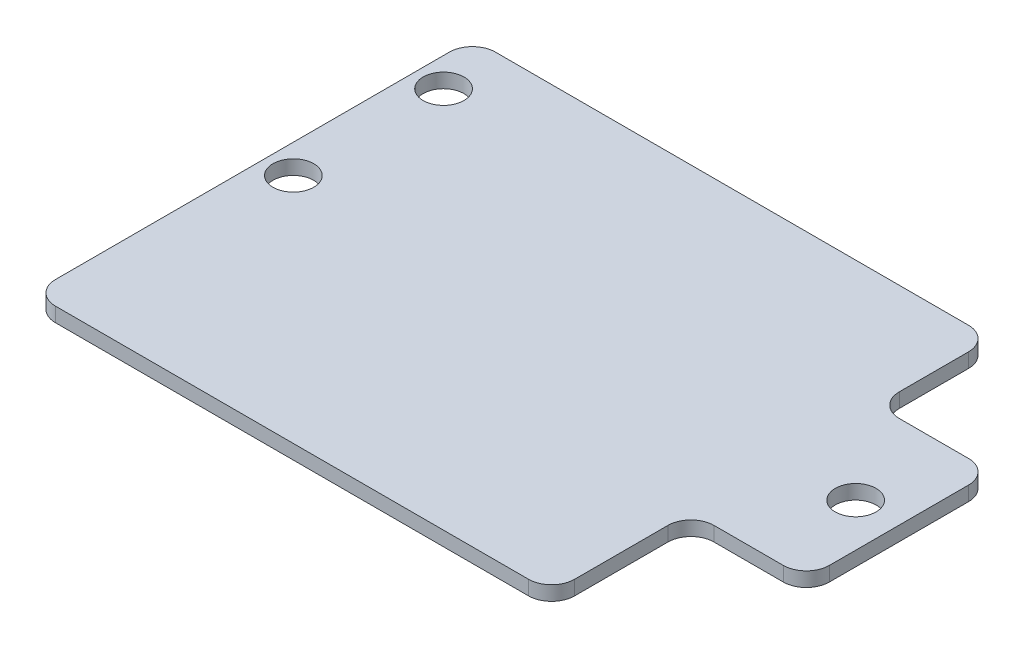
ISO-10303-21;
HEADER;
FILE_DESCRIPTION(('STEP AP214'),'2;1');
FILE_NAME('part.step','',(''),(''),'','','');
FILE_SCHEMA(('AUTOMOTIVE_DESIGN { 1 0 10303 214 1 1 1 1 }'));
ENDSEC;
DATA;
#1=APPLICATION_CONTEXT('core data for automotive mechanical design processes');
#2=APPLICATION_PROTOCOL_DEFINITION('international standard','automotive_design',2000,#1);
#3=PRODUCT_CONTEXT('',#1,'mechanical');
#4=PRODUCT('Part','Part','',(#3));
#5=PRODUCT_RELATED_PRODUCT_CATEGORY('part','',(#4));
#6=PRODUCT_DEFINITION_FORMATION('','',#4);
#7=PRODUCT_DEFINITION_CONTEXT('part definition',#1,'design');
#8=PRODUCT_DEFINITION('design','',#6,#7);
#9=PRODUCT_DEFINITION_SHAPE('','',#8);
#10=(LENGTH_UNIT() NAMED_UNIT(*) SI_UNIT(.MILLI.,.METRE.));
#11=(NAMED_UNIT(*) PLANE_ANGLE_UNIT() SI_UNIT($,.RADIAN.));
#12=(NAMED_UNIT(*) SI_UNIT($,.STERADIAN.) SOLID_ANGLE_UNIT());
#13=UNCERTAINTY_MEASURE_WITH_UNIT(LENGTH_MEASURE(1.E-05),#10,'distance_accuracy_value','');
#14=(GEOMETRIC_REPRESENTATION_CONTEXT(3) GLOBAL_UNCERTAINTY_ASSIGNED_CONTEXT((#13)) GLOBAL_UNIT_ASSIGNED_CONTEXT((#10,
#11,#12)) REPRESENTATION_CONTEXT('',''));
#15=CARTESIAN_POINT('',(0.,0.,0.));
#16=DIRECTION('',(0.,0.,1.));
#17=DIRECTION('',(1.,0.,0.));
#18=AXIS2_PLACEMENT_3D('',#15,#16,#17);
#19=CARTESIAN_POINT('',(0.,1.5875,0.));
#20=DIRECTION('',(0.,0.,1.));
#21=DIRECTION('',(1.,0.,0.));
#22=AXIS2_PLACEMENT_3D('',#19,#20,#21);
#23=PLANE('',#22);
#24=DIRECTION('',(-1.,0.,0.));
#25=VECTOR('',#24,1.);
#26=CARTESIAN_POINT('',(0.,0.,0.));
#27=LINE('',#26,#25);
#28=CARTESIAN_POINT('',(54.61,0.,0.));
#29=VERTEX_POINT('',#28);
#30=CARTESIAN_POINT('',(2.53999999999999,0.,0.));
#31=VERTEX_POINT('',#30);
#32=EDGE_CURVE('E190',#29,#31,#27,.T.);
#33=ORIENTED_EDGE('',*,*,#32,.T.);
#34=DIRECTION('',(0.,-1.,0.));
#35=VECTOR('',#34,1.);
#36=CARTESIAN_POINT('',(2.53999999999999,1.5875,0.));
#37=LINE('',#36,#35);
#38=CARTESIAN_POINT('',(2.53999999999999,1.5875,0.));
#39=VERTEX_POINT('',#38);
#40=EDGE_CURVE('E251',#31,#39,#37,.F.);
#41=ORIENTED_EDGE('',*,*,#40,.T.);
#42=DIRECTION('',(-1.,0.,0.));
#43=VECTOR('',#42,1.);
#44=CARTESIAN_POINT('',(0.,1.5875,0.));
#45=LINE('',#44,#43);
#46=CARTESIAN_POINT('',(54.61,1.5875,0.));
#47=VERTEX_POINT('',#46);
#48=EDGE_CURVE('E208',#47,#39,#45,.T.);
#49=ORIENTED_EDGE('',*,*,#48,.F.);
#50=DIRECTION('',(0.,-1.,0.));
#51=VECTOR('',#50,1.);
#52=CARTESIAN_POINT('',(54.61,1.5875,0.));
#53=LINE('',#52,#51);
#54=EDGE_CURVE('E247',#47,#29,#53,.T.);
#55=ORIENTED_EDGE('',*,*,#54,.T.);
#56=EDGE_LOOP('',(#33,#41,#49,#55));
#57=FACE_BOUND('',#56,.T.);
#58=ADVANCED_FACE('F38',(#57),#23,.F.);
#59=CARTESIAN_POINT('',(0.,1.5875,0.));
#60=DIRECTION('',(1.,0.,0.));
#61=DIRECTION('',(0.,0.,-1.));
#62=AXIS2_PLACEMENT_3D('',#59,#60,#61);
#63=PLANE('',#62);
#64=DIRECTION('',(0.,0.,1.));
#65=VECTOR('',#64,1.);
#66=CARTESIAN_POINT('',(0.,0.,0.));
#67=LINE('',#66,#65);
#68=CARTESIAN_POINT('',(0.,0.,2.54000000000002));
#69=VERTEX_POINT('',#68);
#70=CARTESIAN_POINT('',(3.14143795186701E-13,0.,45.8922608829161));
#71=VERTEX_POINT('',#70);
#72=EDGE_CURVE('E183',#69,#71,#67,.T.);
#73=ORIENTED_EDGE('',*,*,#72,.T.);
#74=DIRECTION('',(0.,-1.,0.));
#75=VECTOR('',#74,1.);
#76=CARTESIAN_POINT('',(3.14143795186701E-13,1.5875,45.8922608829161));
#77=LINE('',#76,#75);
#78=CARTESIAN_POINT('',(3.14143795186701E-13,1.5875,45.8922608829161));
#79=VERTEX_POINT('',#78);
#80=EDGE_CURVE('E157',#71,#79,#77,.F.);
#81=ORIENTED_EDGE('',*,*,#80,.T.);
#82=DIRECTION('',(0.,0.,1.));
#83=VECTOR('',#82,1.);
#84=CARTESIAN_POINT('',(0.,1.5875,0.));
#85=LINE('',#84,#83);
#86=CARTESIAN_POINT('',(0.,1.5875,2.54000000000002));
#87=VERTEX_POINT('',#86);
#88=EDGE_CURVE('E347',#87,#79,#85,.T.);
#89=ORIENTED_EDGE('',*,*,#88,.F.);
#90=DIRECTION('',(0.,-1.,0.));
#91=VECTOR('',#90,1.);
#92=CARTESIAN_POINT('',(0.,1.5875,2.54000000000002));
#93=LINE('',#92,#91);
#94=EDGE_CURVE('E163',#87,#69,#93,.T.);
#95=ORIENTED_EDGE('',*,*,#94,.T.);
#96=EDGE_LOOP('',(#73,#81,#89,#95));
#97=FACE_BOUND('',#96,.T.);
#98=ADVANCED_FACE('F396',(#97),#63,.F.);
#99=CARTESIAN_POINT('',(3.33066907387547E-13,1.5875,48.4322608829161));
#100=DIRECTION('',(0.,0.,-1.));
#101=DIRECTION('',(-1.,0.,0.));
#102=AXIS2_PLACEMENT_3D('',#99,#100,#101);
#103=PLANE('',#102);
#104=DIRECTION('',(1.,0.,0.));
#105=VECTOR('',#104,1.);
#106=CARTESIAN_POINT('',(3.33066907387547E-13,1.5875,48.4322608829161));
#107=LINE('',#106,#105);
#108=CARTESIAN_POINT('',(2.54000000000031,1.5875,48.4322608829161));
#109=VERTEX_POINT('',#108);
#110=CARTESIAN_POINT('',(54.61,1.5875,48.4322608829161));
#111=VERTEX_POINT('',#110);
#112=EDGE_CURVE('E173',#109,#111,#107,.T.);
#113=ORIENTED_EDGE('',*,*,#112,.F.);
#114=DIRECTION('',(0.,-1.,0.));
#115=VECTOR('',#114,1.);
#116=CARTESIAN_POINT('',(2.54000000000031,1.5875,48.4322608829161));
#117=LINE('',#116,#115);
#118=CARTESIAN_POINT('',(2.54000000000031,0.,48.4322608829161));
#119=VERTEX_POINT('',#118);
#120=EDGE_CURVE('E156',#109,#119,#117,.T.);
#121=ORIENTED_EDGE('',*,*,#120,.T.);
#122=DIRECTION('',(1.,0.,0.));
#123=VECTOR('',#122,1.);
#124=CARTESIAN_POINT('',(3.33066907387547E-13,0.,48.4322608829161));
#125=LINE('',#124,#123);
#126=CARTESIAN_POINT('',(54.61,0.,48.4322608829161));
#127=VERTEX_POINT('',#126);
#128=EDGE_CURVE('E170',#119,#127,#125,.T.);
#129=ORIENTED_EDGE('',*,*,#128,.T.);
#130=DIRECTION('',(0.,-1.,0.));
#131=VECTOR('',#130,1.);
#132=CARTESIAN_POINT('',(54.61,1.5875,48.4322608829161));
#133=LINE('',#132,#131);
#134=EDGE_CURVE('E176',#127,#111,#133,.F.);
#135=ORIENTED_EDGE('',*,*,#134,.T.);
#136=EDGE_LOOP('',(#113,#121,#129,#135));
#137=FACE_BOUND('',#136,.T.);
#138=ADVANCED_FACE('F169',(#137),#103,.F.);
#139=CARTESIAN_POINT('',(57.15,1.5875,48.4322608829161));
#140=DIRECTION('',(-1.,0.,0.));
#141=DIRECTION('',(0.,0.,1.));
#142=AXIS2_PLACEMENT_3D('',#139,#140,#141);
#143=PLANE('',#142);
#144=DIRECTION('',(0.,0.,-1.));
#145=VECTOR('',#144,1.);
#146=CARTESIAN_POINT('',(57.15,1.5875,48.4322608829161));
#147=LINE('',#146,#145);
#148=CARTESIAN_POINT('',(57.15,1.5875,45.8922608829161));
#149=VERTEX_POINT('',#148);
#150=CARTESIAN_POINT('',(57.15,1.5875,35.6305011983934));
#151=VERTEX_POINT('',#150);
#152=EDGE_CURVE('E353',#149,#151,#147,.T.);
#153=ORIENTED_EDGE('',*,*,#152,.F.);
#154=DIRECTION('',(0.,-1.,0.));
#155=VECTOR('',#154,1.);
#156=CARTESIAN_POINT('',(57.15,1.5875,45.8922608829161));
#157=LINE('',#156,#155);
#158=CARTESIAN_POINT('',(57.15,0.,45.8922608829161));
#159=VERTEX_POINT('',#158);
#160=EDGE_CURVE('E263',#149,#159,#157,.T.);
#161=ORIENTED_EDGE('',*,*,#160,.T.);
#162=DIRECTION('',(0.,0.,-1.));
#163=VECTOR('',#162,1.);
#164=CARTESIAN_POINT('',(57.15,0.,48.4322608829161));
#165=LINE('',#164,#163);
#166=CARTESIAN_POINT('',(57.15,0.,35.6305011983934));
#167=VERTEX_POINT('',#166);
#168=EDGE_CURVE('E182',#159,#167,#165,.T.);
#169=ORIENTED_EDGE('',*,*,#168,.T.);
#170=DIRECTION('',(0.,-1.,0.));
#171=VECTOR('',#170,1.);
#172=CARTESIAN_POINT('',(57.15,1.5875,35.6305011983934));
#173=LINE('',#172,#171);
#174=EDGE_CURVE('E260',#167,#151,#173,.F.);
#175=ORIENTED_EDGE('',*,*,#174,.T.);
#176=EDGE_LOOP('',(#153,#161,#169,#175));
#177=FACE_BOUND('',#176,.T.);
#178=ADVANCED_FACE('F387',(#177),#143,.F.);
#179=CARTESIAN_POINT('',(57.15,1.5875,33.0905011983934));
#180=DIRECTION('',(0.,0.,-1.));
#181=DIRECTION('',(-1.,0.,0.));
#182=AXIS2_PLACEMENT_3D('',#179,#180,#181);
#183=PLANE('',#182);
#184=DIRECTION('',(1.,0.,0.));
#185=VECTOR('',#184,1.);
#186=CARTESIAN_POINT('',(57.15,0.,33.0905011983934));
#187=LINE('',#186,#185);
#188=CARTESIAN_POINT('',(59.69,0.,33.0905011983934));
#189=VERTEX_POINT('',#188);
#190=CARTESIAN_POINT('',(67.31,0.,33.0905011983934));
#191=VERTEX_POINT('',#190);
#192=EDGE_CURVE('E188',#189,#191,#187,.T.);
#193=ORIENTED_EDGE('',*,*,#192,.T.);
#194=DIRECTION('',(0.,-1.,0.));
#195=VECTOR('',#194,1.);
#196=CARTESIAN_POINT('',(67.31,1.5875,33.0905011983934));
#197=LINE('',#196,#195);
#198=CARTESIAN_POINT('',(67.31,1.5875,33.0905011983934));
#199=VERTEX_POINT('',#198);
#200=EDGE_CURVE('E278',#191,#199,#197,.F.);
#201=ORIENTED_EDGE('',*,*,#200,.T.);
#202=DIRECTION('',(1.,0.,0.));
#203=VECTOR('',#202,1.);
#204=CARTESIAN_POINT('',(57.15,1.5875,33.0905011983934));
#205=LINE('',#204,#203);
#206=CARTESIAN_POINT('',(59.69,1.5875,33.0905011983934));
#207=VERTEX_POINT('',#206);
#208=EDGE_CURVE('E357',#207,#199,#205,.T.);
#209=ORIENTED_EDGE('',*,*,#208,.F.);
#210=DIRECTION('',(0.,-1.,0.));
#211=VECTOR('',#210,1.);
#212=CARTESIAN_POINT('',(59.69,0.,33.0905011983934));
#213=LINE('',#212,#211);
#214=EDGE_CURVE('E274',#207,#189,#213,.T.);
#215=ORIENTED_EDGE('',*,*,#214,.T.);
#216=EDGE_LOOP('',(#193,#201,#209,#215));
#217=FACE_BOUND('',#216,.T.);
#218=ADVANCED_FACE('F378',(#217),#183,.F.);
#219=CARTESIAN_POINT('',(69.85,1.5875,33.0905011983934));
#220=DIRECTION('',(-1.,0.,0.));
#221=DIRECTION('',(0.,0.,1.));
#222=AXIS2_PLACEMENT_3D('',#219,#220,#221);
#223=PLANE('',#222);
#224=DIRECTION('',(0.,0.,-1.));
#225=VECTOR('',#224,1.);
#226=CARTESIAN_POINT('',(69.85,1.5875,33.0905011983934));
#227=LINE('',#226,#225);
#228=CARTESIAN_POINT('',(69.85,1.5875,30.5505011983934));
#229=VERTEX_POINT('',#228);
#230=CARTESIAN_POINT('',(69.85,1.5875,15.24));
#231=VERTEX_POINT('',#230);
#232=EDGE_CURVE('E309',#229,#231,#227,.T.);
#233=ORIENTED_EDGE('',*,*,#232,.F.);
#234=DIRECTION('',(0.,-1.,0.));
#235=VECTOR('',#234,1.);
#236=CARTESIAN_POINT('',(69.85,1.5875,30.5505011983934));
#237=LINE('',#236,#235);
#238=CARTESIAN_POINT('',(69.85,0.,30.5505011983934));
#239=VERTEX_POINT('',#238);
#240=EDGE_CURVE('E270',#229,#239,#237,.T.);
#241=ORIENTED_EDGE('',*,*,#240,.T.);
#242=DIRECTION('',(0.,0.,-1.));
#243=VECTOR('',#242,1.);
#244=CARTESIAN_POINT('',(69.85,0.,33.0905011983934));
#245=LINE('',#244,#243);
#246=CARTESIAN_POINT('',(69.85,0.,15.24));
#247=VERTEX_POINT('',#246);
#248=EDGE_CURVE('E197',#239,#247,#245,.T.);
#249=ORIENTED_EDGE('',*,*,#248,.T.);
#250=DIRECTION('',(0.,-1.,0.));
#251=VECTOR('',#250,1.);
#252=CARTESIAN_POINT('',(69.85,1.5875,15.24));
#253=LINE('',#252,#251);
#254=EDGE_CURVE('E267',#247,#231,#253,.F.);
#255=ORIENTED_EDGE('',*,*,#254,.T.);
#256=EDGE_LOOP('',(#233,#241,#249,#255));
#257=FACE_BOUND('',#256,.T.);
#258=ADVANCED_FACE('F372',(#257),#223,.F.);
#259=CARTESIAN_POINT('',(69.85,1.5875,12.7));
#260=DIRECTION('',(0.,0.,1.));
#261=DIRECTION('',(1.,0.,0.));
#262=AXIS2_PLACEMENT_3D('',#259,#260,#261);
#263=PLANE('',#262);
#264=DIRECTION('',(-1.,0.,0.));
#265=VECTOR('',#264,1.);
#266=CARTESIAN_POINT('',(69.85,1.5875,12.7));
#267=LINE('',#266,#265);
#268=CARTESIAN_POINT('',(67.31,1.5875,12.7));
#269=VERTEX_POINT('',#268);
#270=CARTESIAN_POINT('',(59.69,1.5875,12.7));
#271=VERTEX_POINT('',#270);
#272=EDGE_CURVE('E306',#269,#271,#267,.T.);
#273=ORIENTED_EDGE('',*,*,#272,.F.);
#274=DIRECTION('',(0.,-1.,0.));
#275=VECTOR('',#274,1.);
#276=CARTESIAN_POINT('',(67.31,1.5875,12.7));
#277=LINE('',#276,#275);
#278=CARTESIAN_POINT('',(67.31,0.,12.7));
#279=VERTEX_POINT('',#278);
#280=EDGE_CURVE('E284',#269,#279,#277,.T.);
#281=ORIENTED_EDGE('',*,*,#280,.T.);
#282=DIRECTION('',(-1.,0.,0.));
#283=VECTOR('',#282,1.);
#284=CARTESIAN_POINT('',(69.85,0.,12.7));
#285=LINE('',#284,#283);
#286=CARTESIAN_POINT('',(59.69,0.,12.7));
#287=VERTEX_POINT('',#286);
#288=EDGE_CURVE('E201',#279,#287,#285,.T.);
#289=ORIENTED_EDGE('',*,*,#288,.T.);
#290=DIRECTION('',(0.,-1.,0.));
#291=VECTOR('',#290,1.);
#292=CARTESIAN_POINT('',(59.69,1.5875,12.7));
#293=LINE('',#292,#291);
#294=EDGE_CURVE('E281',#287,#271,#293,.F.);
#295=ORIENTED_EDGE('',*,*,#294,.T.);
#296=EDGE_LOOP('',(#273,#281,#289,#295));
#297=FACE_BOUND('',#296,.T.);
#298=ADVANCED_FACE('F301',(#297),#263,.F.);
#299=CARTESIAN_POINT('',(57.15,1.5875,12.7));
#300=DIRECTION('',(-1.,0.,0.));
#301=DIRECTION('',(0.,0.,1.));
#302=AXIS2_PLACEMENT_3D('',#299,#300,#301);
#303=PLANE('',#302);
#304=DIRECTION('',(0.,0.,-1.));
#305=VECTOR('',#304,1.);
#306=CARTESIAN_POINT('',(57.15,0.,12.7));
#307=LINE('',#306,#305);
#308=CARTESIAN_POINT('',(57.15,0.,10.16));
#309=VERTEX_POINT('',#308);
#310=CARTESIAN_POINT('',(57.15,0.,2.54));
#311=VERTEX_POINT('',#310);
#312=EDGE_CURVE('E205',#309,#311,#307,.T.);
#313=ORIENTED_EDGE('',*,*,#312,.T.);
#314=DIRECTION('',(0.,-1.,0.));
#315=VECTOR('',#314,1.);
#316=CARTESIAN_POINT('',(57.15,1.5875,2.54));
#317=LINE('',#316,#315);
#318=CARTESIAN_POINT('',(57.15,1.5875,2.54));
#319=VERTEX_POINT('',#318);
#320=EDGE_CURVE('E54',#311,#319,#317,.F.);
#321=ORIENTED_EDGE('',*,*,#320,.T.);
#322=DIRECTION('',(0.,0.,-1.));
#323=VECTOR('',#322,1.);
#324=CARTESIAN_POINT('',(57.15,1.5875,12.7));
#325=LINE('',#324,#323);
#326=CARTESIAN_POINT('',(57.15,1.5875,10.16));
#327=VERTEX_POINT('',#326);
#328=EDGE_CURVE('E210',#327,#319,#325,.T.);
#329=ORIENTED_EDGE('',*,*,#328,.F.);
#330=DIRECTION('',(0.,-1.,0.));
#331=VECTOR('',#330,1.);
#332=CARTESIAN_POINT('',(57.15,0.,10.16));
#333=LINE('',#332,#331);
#334=EDGE_CURVE('E254',#327,#309,#333,.T.);
#335=ORIENTED_EDGE('',*,*,#334,.T.);
#336=EDGE_LOOP('',(#313,#321,#329,#335));
#337=FACE_BOUND('',#336,.T.);
#338=ADVANCED_FACE('F303',(#337),#303,.F.);
#339=CARTESIAN_POINT('',(0.,1.5875,0.));
#340=DIRECTION('',(0.,1.,0.));
#341=DIRECTION('',(0.,0.,1.));
#342=AXIS2_PLACEMENT_3D('',#339,#340,#341);
#343=PLANE('',#342);
#344=CARTESIAN_POINT('',(3.17499999999999,1.5875,6.35));
#345=DIRECTION('',(0.,1.,0.));
#346=DIRECTION('',(0.,0.,1.));
#347=AXIS2_PLACEMENT_3D('',#344,#345,#346);
#348=CIRCLE('',#347,2.2479);
#349=CARTESIAN_POINT('',(3.17499999999999,1.5875,8.5979));
#350=VERTEX_POINT('',#349);
#351=EDGE_CURVE('E320',#350,#350,#348,.T.);
#352=ORIENTED_EDGE('',*,*,#351,.F.);
#353=EDGE_LOOP('',(#352));
#354=FACE_BOUND('',#353,.T.);
#355=CARTESIAN_POINT('',(3.17499999999999,1.5875,22.8854));
#356=DIRECTION('',(0.,1.,0.));
#357=DIRECTION('',(0.,0.,1.));
#358=AXIS2_PLACEMENT_3D('',#355,#356,#357);
#359=CIRCLE('',#358,2.2479);
#360=CARTESIAN_POINT('',(3.17499999999999,1.5875,25.1333));
#361=VERTEX_POINT('',#360);
#362=EDGE_CURVE('E332',#361,#361,#359,.T.);
#363=ORIENTED_EDGE('',*,*,#362,.F.);
#364=EDGE_LOOP('',(#363));
#365=FACE_BOUND('',#364,.T.);
#366=CARTESIAN_POINT('',(65.0748,1.5875,22.8854));
#367=DIRECTION('',(0.,1.,0.));
#368=DIRECTION('',(0.,0.,1.));
#369=AXIS2_PLACEMENT_3D('',#366,#367,#368);
#370=CIRCLE('',#369,2.2479);
#371=CARTESIAN_POINT('',(65.0748,1.5875,25.1333));
#372=VERTEX_POINT('',#371);
#373=EDGE_CURVE('E340',#372,#372,#370,.T.);
#374=ORIENTED_EDGE('',*,*,#373,.F.);
#375=EDGE_LOOP('',(#374));
#376=FACE_BOUND('',#375,.T.);
#377=ORIENTED_EDGE('',*,*,#88,.T.);
#378=CARTESIAN_POINT('',(2.54000000000031,1.5875,45.8922608829161));
#379=DIRECTION('',(0.,1.,0.));
#380=DIRECTION('',(0.,0.,1.));
#381=AXIS2_PLACEMENT_3D('',#378,#379,#380);
#382=CIRCLE('',#381,2.54);
#383=EDGE_CURVE('E244',#79,#109,#382,.T.);
#384=ORIENTED_EDGE('',*,*,#383,.T.);
#385=ORIENTED_EDGE('',*,*,#112,.T.);
#386=CARTESIAN_POINT('',(54.61,1.5875,45.8922608829161));
#387=DIRECTION('',(0.,1.,0.));
#388=DIRECTION('',(0.,0.,1.));
#389=AXIS2_PLACEMENT_3D('',#386,#387,#388);
#390=CIRCLE('',#389,2.54);
#391=EDGE_CURVE('E235',#111,#149,#390,.T.);
#392=ORIENTED_EDGE('',*,*,#391,.T.);
#393=ORIENTED_EDGE('',*,*,#152,.T.);
#394=CARTESIAN_POINT('',(59.69,1.5875,35.6305011983934));
#395=DIRECTION('',(0.,1.,0.));
#396=DIRECTION('',(0.,0.,1.));
#397=AXIS2_PLACEMENT_3D('',#394,#395,#396);
#398=CIRCLE('',#397,2.54);
#399=EDGE_CURVE('E291',#151,#207,#398,.F.);
#400=ORIENTED_EDGE('',*,*,#399,.T.);
#401=ORIENTED_EDGE('',*,*,#208,.T.);
#402=CARTESIAN_POINT('',(67.31,1.5875,30.5505011983934));
#403=DIRECTION('',(0.,1.,0.));
#404=DIRECTION('',(0.,0.,1.));
#405=AXIS2_PLACEMENT_3D('',#402,#403,#404);
#406=CIRCLE('',#405,2.54);
#407=EDGE_CURVE('E232',#199,#229,#406,.T.);
#408=ORIENTED_EDGE('',*,*,#407,.T.);
#409=ORIENTED_EDGE('',*,*,#232,.T.);
#410=CARTESIAN_POINT('',(67.31,1.5875,15.24));
#411=DIRECTION('',(0.,1.,0.));
#412=DIRECTION('',(0.,0.,1.));
#413=AXIS2_PLACEMENT_3D('',#410,#411,#412);
#414=CIRCLE('',#413,2.54);
#415=EDGE_CURVE('E229',#231,#269,#414,.T.);
#416=ORIENTED_EDGE('',*,*,#415,.T.);
#417=ORIENTED_EDGE('',*,*,#272,.T.);
#418=CARTESIAN_POINT('',(59.69,1.5875,10.16));
#419=DIRECTION('',(0.,1.,0.));
#420=DIRECTION('',(0.,0.,1.));
#421=AXIS2_PLACEMENT_3D('',#418,#419,#420);
#422=CIRCLE('',#421,2.54);
#423=EDGE_CURVE('E11',#271,#327,#422,.F.);
#424=ORIENTED_EDGE('',*,*,#423,.T.);
#425=ORIENTED_EDGE('',*,*,#328,.T.);
#426=CARTESIAN_POINT('',(54.61,1.5875,2.54));
#427=DIRECTION('',(0.,1.,0.));
#428=DIRECTION('',(0.,0.,1.));
#429=AXIS2_PLACEMENT_3D('',#426,#427,#428);
#430=CIRCLE('',#429,2.54);
#431=EDGE_CURVE('E238',#319,#47,#430,.T.);
#432=ORIENTED_EDGE('',*,*,#431,.T.);
#433=ORIENTED_EDGE('',*,*,#48,.T.);
#434=CARTESIAN_POINT('',(2.53999999999999,1.5875,2.54));
#435=DIRECTION('',(0.,1.,0.));
#436=DIRECTION('',(0.,0.,1.));
#437=AXIS2_PLACEMENT_3D('',#434,#435,#436);
#438=CIRCLE('',#437,2.54);
#439=EDGE_CURVE('E241',#39,#87,#438,.T.);
#440=ORIENTED_EDGE('',*,*,#439,.T.);
#441=EDGE_LOOP('',(#377,#384,#385,#392,#393,#400,#401,#408,#409,#416,#417,#424,#425,#432,#433,#440));
#442=FACE_BOUND('',#441,.T.);
#443=ADVANCED_FACE('F364',(#354,#365,#376,#442),#343,.T.);
#444=CARTESIAN_POINT('',(0.,0.,0.));
#445=DIRECTION('',(0.,1.,0.));
#446=DIRECTION('',(0.,0.,1.));
#447=AXIS2_PLACEMENT_3D('',#444,#445,#446);
#448=PLANE('',#447);
#449=CARTESIAN_POINT('',(3.17499999999999,0.,6.35));
#450=DIRECTION('',(0.,1.,0.));
#451=DIRECTION('',(0.,0.,1.));
#452=AXIS2_PLACEMENT_3D('',#449,#450,#451);
#453=CIRCLE('',#452,2.2479);
#454=CARTESIAN_POINT('',(3.17499999999999,0.,8.5979));
#455=VERTEX_POINT('',#454);
#456=EDGE_CURVE('E314',#455,#455,#453,.T.);
#457=ORIENTED_EDGE('',*,*,#456,.T.);
#458=EDGE_LOOP('',(#457));
#459=FACE_BOUND('',#458,.T.);
#460=CARTESIAN_POINT('',(3.17499999999999,0.,22.8854));
#461=DIRECTION('',(0.,1.,0.));
#462=DIRECTION('',(0.,0.,1.));
#463=AXIS2_PLACEMENT_3D('',#460,#461,#462);
#464=CIRCLE('',#463,2.2479);
#465=CARTESIAN_POINT('',(3.17499999999999,0.,25.1333));
#466=VERTEX_POINT('',#465);
#467=EDGE_CURVE('E326',#466,#466,#464,.T.);
#468=ORIENTED_EDGE('',*,*,#467,.T.);
#469=EDGE_LOOP('',(#468));
#470=FACE_BOUND('',#469,.T.);
#471=CARTESIAN_POINT('',(65.0748,0.,22.8854));
#472=DIRECTION('',(0.,1.,0.));
#473=DIRECTION('',(0.,0.,1.));
#474=AXIS2_PLACEMENT_3D('',#471,#472,#473);
#475=CIRCLE('',#474,2.2479);
#476=CARTESIAN_POINT('',(65.0748,0.,25.1333));
#477=VERTEX_POINT('',#476);
#478=EDGE_CURVE('E336',#477,#477,#475,.T.);
#479=ORIENTED_EDGE('',*,*,#478,.T.);
#480=EDGE_LOOP('',(#479));
#481=FACE_BOUND('',#480,.T.);
#482=ORIENTED_EDGE('',*,*,#128,.F.);
#483=CARTESIAN_POINT('',(2.54000000000031,0.,45.8922608829161));
#484=DIRECTION('',(0.,1.,0.));
#485=DIRECTION('',(0.,0.,1.));
#486=AXIS2_PLACEMENT_3D('',#483,#484,#485);
#487=CIRCLE('',#486,2.54);
#488=EDGE_CURVE('E152',#119,#71,#487,.F.);
#489=ORIENTED_EDGE('',*,*,#488,.T.);
#490=ORIENTED_EDGE('',*,*,#72,.F.);
#491=CARTESIAN_POINT('',(2.53999999999999,0.,2.54));
#492=DIRECTION('',(0.,1.,0.));
#493=DIRECTION('',(0.,0.,1.));
#494=AXIS2_PLACEMENT_3D('',#491,#492,#493);
#495=CIRCLE('',#494,2.54);
#496=EDGE_CURVE('E164',#69,#31,#495,.F.);
#497=ORIENTED_EDGE('',*,*,#496,.T.);
#498=ORIENTED_EDGE('',*,*,#32,.F.);
#499=CARTESIAN_POINT('',(54.61,0.,2.54));
#500=DIRECTION('',(0.,1.,0.));
#501=DIRECTION('',(0.,0.,1.));
#502=AXIS2_PLACEMENT_3D('',#499,#500,#501);
#503=CIRCLE('',#502,2.54);
#504=EDGE_CURVE('E219',#29,#311,#503,.F.);
#505=ORIENTED_EDGE('',*,*,#504,.T.);
#506=ORIENTED_EDGE('',*,*,#312,.F.);
#507=CARTESIAN_POINT('',(59.69,0.,10.16));
#508=DIRECTION('',(0.,1.,0.));
#509=DIRECTION('',(0.,0.,1.));
#510=AXIS2_PLACEMENT_3D('',#507,#508,#509);
#511=CIRCLE('',#510,2.54);
#512=EDGE_CURVE('E47',#309,#287,#511,.T.);
#513=ORIENTED_EDGE('',*,*,#512,.T.);
#514=ORIENTED_EDGE('',*,*,#288,.F.);
#515=CARTESIAN_POINT('',(67.31,0.,15.24));
#516=DIRECTION('',(0.,1.,0.));
#517=DIRECTION('',(0.,0.,1.));
#518=AXIS2_PLACEMENT_3D('',#515,#516,#517);
#519=CIRCLE('',#518,2.54);
#520=EDGE_CURVE('E175',#279,#247,#519,.F.);
#521=ORIENTED_EDGE('',*,*,#520,.T.);
#522=ORIENTED_EDGE('',*,*,#248,.F.);
#523=CARTESIAN_POINT('',(67.31,0.,30.5505011983934));
#524=DIRECTION('',(0.,1.,0.));
#525=DIRECTION('',(0.,0.,1.));
#526=AXIS2_PLACEMENT_3D('',#523,#524,#525);
#527=CIRCLE('',#526,2.54);
#528=EDGE_CURVE('E214',#239,#191,#527,.F.);
#529=ORIENTED_EDGE('',*,*,#528,.T.);
#530=ORIENTED_EDGE('',*,*,#192,.F.);
#531=CARTESIAN_POINT('',(59.69,0.,35.6305011983934));
#532=DIRECTION('',(0.,1.,0.));
#533=DIRECTION('',(0.,0.,1.));
#534=AXIS2_PLACEMENT_3D('',#531,#532,#533);
#535=CIRCLE('',#534,2.54);
#536=EDGE_CURVE('E288',#189,#167,#535,.T.);
#537=ORIENTED_EDGE('',*,*,#536,.T.);
#538=ORIENTED_EDGE('',*,*,#168,.F.);
#539=CARTESIAN_POINT('',(54.61,0.,45.8922608829161));
#540=DIRECTION('',(0.,1.,0.));
#541=DIRECTION('',(0.,0.,1.));
#542=AXIS2_PLACEMENT_3D('',#539,#540,#541);
#543=CIRCLE('',#542,2.54);
#544=EDGE_CURVE('E180',#159,#127,#543,.F.);
#545=ORIENTED_EDGE('',*,*,#544,.T.);
#546=EDGE_LOOP('',(#482,#489,#490,#497,#498,#505,#506,#513,#514,#521,#522,#529,#530,#537,#538,#545));
#547=FACE_BOUND('',#546,.T.);
#548=ADVANCED_FACE('F178',(#459,#470,#481,#547),#448,.F.);
#549=CARTESIAN_POINT('',(2.54000000000031,1.5875,45.8922608829161));
#550=DIRECTION('',(0.,-1.,0.));
#551=DIRECTION('',(0.,0.,-1.));
#552=AXIS2_PLACEMENT_3D('',#549,#550,#551);
#553=CYLINDRICAL_SURFACE('',#552,2.54);
#554=ORIENTED_EDGE('',*,*,#383,.F.);
#555=ORIENTED_EDGE('',*,*,#80,.F.);
#556=ORIENTED_EDGE('',*,*,#488,.F.);
#557=ORIENTED_EDGE('',*,*,#120,.F.);
#558=EDGE_LOOP('',(#554,#555,#556,#557));
#559=FACE_BOUND('',#558,.T.);
#560=ADVANCED_FACE('F155',(#559),#553,.T.);
#561=CARTESIAN_POINT('',(2.53999999999999,1.5875,2.54));
#562=DIRECTION('',(0.,-1.,0.));
#563=DIRECTION('',(0.,0.,-1.));
#564=AXIS2_PLACEMENT_3D('',#561,#562,#563);
#565=CYLINDRICAL_SURFACE('',#564,2.54);
#566=ORIENTED_EDGE('',*,*,#439,.F.);
#567=ORIENTED_EDGE('',*,*,#40,.F.);
#568=ORIENTED_EDGE('',*,*,#496,.F.);
#569=ORIENTED_EDGE('',*,*,#94,.F.);
#570=EDGE_LOOP('',(#566,#567,#568,#569));
#571=FACE_BOUND('',#570,.T.);
#572=ADVANCED_FACE('F398',(#571),#565,.T.);
#573=CARTESIAN_POINT('',(54.61,1.5875,2.54));
#574=DIRECTION('',(0.,-1.,0.));
#575=DIRECTION('',(0.,0.,-1.));
#576=AXIS2_PLACEMENT_3D('',#573,#574,#575);
#577=CYLINDRICAL_SURFACE('',#576,2.54);
#578=ORIENTED_EDGE('',*,*,#431,.F.);
#579=ORIENTED_EDGE('',*,*,#320,.F.);
#580=ORIENTED_EDGE('',*,*,#504,.F.);
#581=ORIENTED_EDGE('',*,*,#54,.F.);
#582=EDGE_LOOP('',(#578,#579,#580,#581));
#583=FACE_BOUND('',#582,.T.);
#584=ADVANCED_FACE('F401',(#583),#577,.T.);
#585=CARTESIAN_POINT('',(54.61,1.5875,45.8922608829161));
#586=DIRECTION('',(0.,-1.,0.));
#587=DIRECTION('',(0.,0.,-1.));
#588=AXIS2_PLACEMENT_3D('',#585,#586,#587);
#589=CYLINDRICAL_SURFACE('',#588,2.54);
#590=ORIENTED_EDGE('',*,*,#391,.F.);
#591=ORIENTED_EDGE('',*,*,#134,.F.);
#592=ORIENTED_EDGE('',*,*,#544,.F.);
#593=ORIENTED_EDGE('',*,*,#160,.F.);
#594=EDGE_LOOP('',(#590,#591,#592,#593));
#595=FACE_BOUND('',#594,.T.);
#596=ADVANCED_FACE('F391',(#595),#589,.T.);
#597=CARTESIAN_POINT('',(67.31,1.5875,30.5505011983934));
#598=DIRECTION('',(0.,-1.,0.));
#599=DIRECTION('',(0.,0.,-1.));
#600=AXIS2_PLACEMENT_3D('',#597,#598,#599);
#601=CYLINDRICAL_SURFACE('',#600,2.54);
#602=ORIENTED_EDGE('',*,*,#407,.F.);
#603=ORIENTED_EDGE('',*,*,#200,.F.);
#604=ORIENTED_EDGE('',*,*,#528,.F.);
#605=ORIENTED_EDGE('',*,*,#240,.F.);
#606=EDGE_LOOP('',(#602,#603,#604,#605));
#607=FACE_BOUND('',#606,.T.);
#608=ADVANCED_FACE('F374',(#607),#601,.T.);
#609=CARTESIAN_POINT('',(67.31,1.5875,15.24));
#610=DIRECTION('',(0.,-1.,0.));
#611=DIRECTION('',(0.,0.,-1.));
#612=AXIS2_PLACEMENT_3D('',#609,#610,#611);
#613=CYLINDRICAL_SURFACE('',#612,2.54);
#614=ORIENTED_EDGE('',*,*,#415,.F.);
#615=ORIENTED_EDGE('',*,*,#254,.F.);
#616=ORIENTED_EDGE('',*,*,#520,.F.);
#617=ORIENTED_EDGE('',*,*,#280,.F.);
#618=EDGE_LOOP('',(#614,#615,#616,#617));
#619=FACE_BOUND('',#618,.T.);
#620=ADVANCED_FACE('F370',(#619),#613,.T.);
#621=CARTESIAN_POINT('',(59.69,1.5875,35.6305011983934));
#622=DIRECTION('',(0.,1.,0.));
#623=DIRECTION('',(0.,0.,1.));
#624=AXIS2_PLACEMENT_3D('',#621,#622,#623);
#625=CYLINDRICAL_SURFACE('',#624,2.54);
#626=ORIENTED_EDGE('',*,*,#399,.F.);
#627=ORIENTED_EDGE('',*,*,#174,.F.);
#628=ORIENTED_EDGE('',*,*,#536,.F.);
#629=ORIENTED_EDGE('',*,*,#214,.F.);
#630=EDGE_LOOP('',(#626,#627,#628,#629));
#631=FACE_BOUND('',#630,.T.);
#632=ADVANCED_FACE('F383',(#631),#625,.F.);
#633=CARTESIAN_POINT('',(59.69,1.5875,10.16));
#634=DIRECTION('',(0.,1.,0.));
#635=DIRECTION('',(0.,0.,1.));
#636=AXIS2_PLACEMENT_3D('',#633,#634,#635);
#637=CYLINDRICAL_SURFACE('',#636,2.54);
#638=ORIENTED_EDGE('',*,*,#423,.F.);
#639=ORIENTED_EDGE('',*,*,#294,.F.);
#640=ORIENTED_EDGE('',*,*,#512,.F.);
#641=ORIENTED_EDGE('',*,*,#334,.F.);
#642=EDGE_LOOP('',(#638,#639,#640,#641));
#643=FACE_BOUND('',#642,.T.);
#644=ADVANCED_FACE('F40',(#643),#637,.F.);
#645=CARTESIAN_POINT('',(65.0748,0.,22.8854));
#646=DIRECTION('',(0.,1.,0.));
#647=DIRECTION('',(0.,0.,1.));
#648=AXIS2_PLACEMENT_3D('',#645,#646,#647);
#649=CYLINDRICAL_SURFACE('',#648,2.2479);
#650=ORIENTED_EDGE('',*,*,#478,.F.);
#651=EDGE_LOOP('',(#650));
#652=FACE_BOUND('',#651,.T.);
#653=ORIENTED_EDGE('',*,*,#373,.T.);
#654=EDGE_LOOP('',(#653));
#655=FACE_BOUND('',#654,.T.);
#656=ADVANCED_FACE('F426',(#652,#655),#649,.F.);
#657=CARTESIAN_POINT('',(3.17499999999999,0.,22.8854));
#658=DIRECTION('',(0.,1.,0.));
#659=DIRECTION('',(0.,0.,1.));
#660=AXIS2_PLACEMENT_3D('',#657,#658,#659);
#661=CYLINDRICAL_SURFACE('',#660,2.2479);
#662=ORIENTED_EDGE('',*,*,#467,.F.);
#663=EDGE_LOOP('',(#662));
#664=FACE_BOUND('',#663,.T.);
#665=ORIENTED_EDGE('',*,*,#362,.T.);
#666=EDGE_LOOP('',(#665));
#667=FACE_BOUND('',#666,.T.);
#668=ADVANCED_FACE('F430',(#664,#667),#661,.F.);
#669=CARTESIAN_POINT('',(3.17499999999999,0.,6.35));
#670=DIRECTION('',(0.,1.,0.));
#671=DIRECTION('',(0.,0.,1.));
#672=AXIS2_PLACEMENT_3D('',#669,#670,#671);
#673=CYLINDRICAL_SURFACE('',#672,2.2479);
#674=ORIENTED_EDGE('',*,*,#456,.F.);
#675=EDGE_LOOP('',(#674));
#676=FACE_BOUND('',#675,.T.);
#677=ORIENTED_EDGE('',*,*,#351,.T.);
#678=EDGE_LOOP('',(#677));
#679=FACE_BOUND('',#678,.T.);
#680=ADVANCED_FACE('F436',(#676,#679),#673,.F.);
#681=CLOSED_SHELL('',(#58,#98,#138,#178,#218,#258,#298,#338,#443,#548,#560,#572,#584,#596,#608,
#620,#632,#644,#656,#668,#680));
#682=MANIFOLD_SOLID_BREP('B2',#681);
#683=ADVANCED_BREP_SHAPE_REPRESENTATION('',(#18,#682),#14);
#684=SHAPE_DEFINITION_REPRESENTATION(#9,#683);
ENDSEC;
END-ISO-10303-21;
